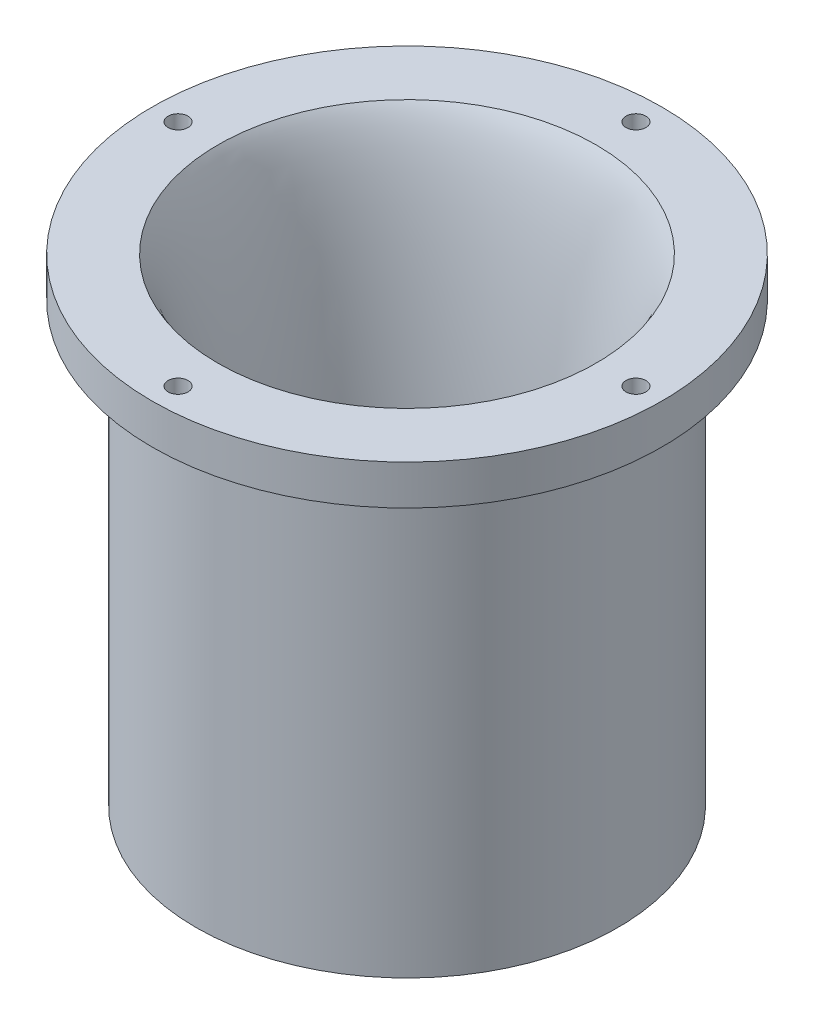
ISO-10303-21;
HEADER;
FILE_DESCRIPTION(('STEP AP214'),'2;1');
FILE_NAME('part.step','',(''),(''),'','','');
FILE_SCHEMA(('AUTOMOTIVE_DESIGN { 1 0 10303 214 1 1 1 1 }'));
ENDSEC;
DATA;
#1=APPLICATION_CONTEXT('core data for automotive mechanical design processes');
#2=APPLICATION_PROTOCOL_DEFINITION('international standard','automotive_design',2000,#1);
#3=PRODUCT_CONTEXT('',#1,'mechanical');
#4=PRODUCT('Part','Part','',(#3));
#5=PRODUCT_RELATED_PRODUCT_CATEGORY('part','',(#4));
#6=PRODUCT_DEFINITION_FORMATION('','',#4);
#7=PRODUCT_DEFINITION_CONTEXT('part definition',#1,'design');
#8=PRODUCT_DEFINITION('design','',#6,#7);
#9=PRODUCT_DEFINITION_SHAPE('','',#8);
#10=(LENGTH_UNIT() NAMED_UNIT(*) SI_UNIT(.MILLI.,.METRE.));
#11=(NAMED_UNIT(*) PLANE_ANGLE_UNIT() SI_UNIT($,.RADIAN.));
#12=(NAMED_UNIT(*) SI_UNIT($,.STERADIAN.) SOLID_ANGLE_UNIT());
#13=UNCERTAINTY_MEASURE_WITH_UNIT(LENGTH_MEASURE(1.E-05),#10,'distance_accuracy_value','');
#14=(GEOMETRIC_REPRESENTATION_CONTEXT(3) GLOBAL_UNCERTAINTY_ASSIGNED_CONTEXT((#13)) GLOBAL_UNIT_ASSIGNED_CONTEXT((#10,
#11,#12)) REPRESENTATION_CONTEXT('',''));
#15=CARTESIAN_POINT('',(0.,0.,0.));
#16=DIRECTION('',(0.,0.,1.));
#17=DIRECTION('',(1.,0.,0.));
#18=AXIS2_PLACEMENT_3D('',#15,#16,#17);
#19=CARTESIAN_POINT('',(0.,0.,-35.));
#20=CARTESIAN_POINT('',(0.,0.743462171305286,-35.));
#21=CARTESIAN_POINT('',(0.,3.60426320335067,-35.0360451741196));
#22=CARTESIAN_POINT('',(0.,30.1874880901123,-34.5551949604651));
#23=CARTESIAN_POINT('',(0.,87.1238245562337,-38.452213163152));
#24=CARTESIAN_POINT('',(0.,100.,-47.5));
#25=B_SPLINE_CURVE_WITH_KNOTS('',3,(#19,#20,#21,#22,#23,#24),.UNSPECIFIED.,.F.,.F.,(4,1,1,4),
(0.,0.0402839169169661,0.140283916916966,1.),.UNSPECIFIED.);
#26=CARTESIAN_POINT('',(0.,0.,0.));
#27=DIRECTION('',(0.,-1.,0.));
#28=AXIS1_PLACEMENT('',#26,#27);
#29=SURFACE_OF_REVOLUTION('',#25,#28);
#30=CARTESIAN_POINT('',(0.,100.,0.));
#31=DIRECTION('',(0.,-1.,0.));
#32=DIRECTION('',(0.,0.,-1.));
#33=AXIS2_PLACEMENT_3D('',#30,#31,#32);
#34=CIRCLE('',#33,47.5);
#35=CARTESIAN_POINT('',(0.,100.,-47.5));
#36=VERTEX_POINT('',#35);
#37=EDGE_CURVE('E65',#36,#36,#34,.T.);
#38=ORIENTED_EDGE('',*,*,#37,.F.);
#39=EDGE_LOOP('',(#38));
#40=FACE_BOUND('',#39,.T.);
#41=CARTESIAN_POINT('',(0.,0.,0.));
#42=DIRECTION('',(0.,-1.,0.));
#43=DIRECTION('',(0.,0.,-1.));
#44=AXIS2_PLACEMENT_3D('',#41,#42,#43);
#45=CIRCLE('',#44,35.);
#46=CARTESIAN_POINT('',(0.,0.,-35.));
#47=VERTEX_POINT('',#46);
#48=EDGE_CURVE('E10',#47,#47,#45,.T.);
#49=ORIENTED_EDGE('',*,*,#48,.T.);
#50=EDGE_LOOP('',(#49));
#51=FACE_BOUND('',#50,.T.);
#52=ADVANCED_FACE('F36',(#40,#51),#29,.T.);
#53=CARTESIAN_POINT('',(0.,0.,0.));
#54=DIRECTION('',(0.,-1.,0.));
#55=DIRECTION('',(0.,0.,-1.));
#56=AXIS2_PLACEMENT_3D('',#53,#54,#55);
#57=PLANE('',#56);
#58=CARTESIAN_POINT('',(0.,0.,0.));
#59=DIRECTION('',(0.,-1.,0.));
#60=DIRECTION('',(0.,0.,-1.));
#61=AXIS2_PLACEMENT_3D('',#58,#59,#60);
#62=CIRCLE('',#61,38.);
#63=CARTESIAN_POINT('',(0.,0.,-38.));
#64=VERTEX_POINT('',#63);
#65=EDGE_CURVE('E43',#64,#64,#62,.T.);
#66=ORIENTED_EDGE('',*,*,#65,.T.);
#67=EDGE_LOOP('',(#66));
#68=FACE_BOUND('',#67,.T.);
#69=ORIENTED_EDGE('',*,*,#48,.F.);
#70=EDGE_LOOP('',(#69));
#71=FACE_BOUND('',#70,.T.);
#72=ADVANCED_FACE('F135',(#68,#71),#57,.T.);
#73=CARTESIAN_POINT('',(0.,0.,0.));
#74=DIRECTION('',(0.,-1.,0.));
#75=DIRECTION('',(0.,0.,-1.));
#76=AXIS2_PLACEMENT_3D('',#73,#74,#75);
#77=CYLINDRICAL_SURFACE('',#76,38.);
#78=CARTESIAN_POINT('',(0.,-20.,0.));
#79=DIRECTION('',(0.,-1.,0.));
#80=DIRECTION('',(0.,0.,-1.));
#81=AXIS2_PLACEMENT_3D('',#78,#79,#80);
#82=CIRCLE('',#81,38.);
#83=CARTESIAN_POINT('',(0.,-20.,-38.));
#84=VERTEX_POINT('',#83);
#85=EDGE_CURVE('E47',#84,#84,#82,.T.);
#86=ORIENTED_EDGE('',*,*,#85,.T.);
#87=EDGE_LOOP('',(#86));
#88=FACE_BOUND('',#87,.T.);
#89=ORIENTED_EDGE('',*,*,#65,.F.);
#90=EDGE_LOOP('',(#89));
#91=FACE_BOUND('',#90,.T.);
#92=ADVANCED_FACE('F140',(#88,#91),#77,.F.);
#93=CARTESIAN_POINT('',(0.,-20.,0.));
#94=DIRECTION('',(0.,-1.,0.));
#95=DIRECTION('',(0.,0.,-1.));
#96=AXIS2_PLACEMENT_3D('',#93,#94,#95);
#97=PLANE('',#96);
#98=CARTESIAN_POINT('',(0.,-20.,0.));
#99=DIRECTION('',(0.,-1.,0.));
#100=DIRECTION('',(0.,0.,-1.));
#101=AXIS2_PLACEMENT_3D('',#98,#99,#100);
#102=CIRCLE('',#101,53.);
#103=CARTESIAN_POINT('',(0.,-20.,-53.));
#104=VERTEX_POINT('',#103);
#105=EDGE_CURVE('E51',#104,#104,#102,.T.);
#106=ORIENTED_EDGE('',*,*,#105,.T.);
#107=EDGE_LOOP('',(#106));
#108=FACE_BOUND('',#107,.T.);
#109=ORIENTED_EDGE('',*,*,#85,.F.);
#110=EDGE_LOOP('',(#109));
#111=FACE_BOUND('',#110,.T.);
#112=ADVANCED_FACE('F144',(#108,#111),#97,.T.);
#113=CARTESIAN_POINT('',(0.,0.,0.));
#114=DIRECTION('',(0.,-1.,0.));
#115=DIRECTION('',(0.,0.,-1.));
#116=AXIS2_PLACEMENT_3D('',#113,#114,#115);
#117=CYLINDRICAL_SURFACE('',#116,53.);
#118=CARTESIAN_POINT('',(0.,90.,0.));
#119=DIRECTION('',(0.,-1.,0.));
#120=DIRECTION('',(0.,0.,-1.));
#121=AXIS2_PLACEMENT_3D('',#118,#119,#120);
#122=CIRCLE('',#121,53.);
#123=CARTESIAN_POINT('',(0.,90.,-53.));
#124=VERTEX_POINT('',#123);
#125=EDGE_CURVE('E56',#124,#124,#122,.T.);
#126=ORIENTED_EDGE('',*,*,#125,.T.);
#127=EDGE_LOOP('',(#126));
#128=FACE_BOUND('',#127,.T.);
#129=ORIENTED_EDGE('',*,*,#105,.F.);
#130=EDGE_LOOP('',(#129));
#131=FACE_BOUND('',#130,.T.);
#132=ADVANCED_FACE('F131',(#128,#131),#117,.T.);
#133=CARTESIAN_POINT('',(0.,90.,0.));
#134=DIRECTION('',(0.,-1.,0.));
#135=DIRECTION('',(0.,0.,-1.));
#136=AXIS2_PLACEMENT_3D('',#133,#134,#135);
#137=PLANE('',#136);
#138=CARTESIAN_POINT('',(1.62720657315313E-12,90.,-57.5));
#139=DIRECTION('',(0.,1.,0.));
#140=DIRECTION('',(0.,0.,1.));
#141=AXIS2_PLACEMENT_3D('',#138,#139,#140);
#142=CIRCLE('',#141,2.49999999999844);
#143=CARTESIAN_POINT('',(1.62720657315313E-12,90.,-55.0000000000016));
#144=VERTEX_POINT('',#143);
#145=EDGE_CURVE('E67',#144,#144,#142,.T.);
#146=ORIENTED_EDGE('',*,*,#145,.T.);
#147=EDGE_LOOP('',(#146));
#148=FACE_BOUND('',#147,.T.);
#149=CARTESIAN_POINT('',(57.5000000000016,90.,0.));
#150=DIRECTION('',(0.,1.,0.));
#151=DIRECTION('',(0.,0.,1.));
#152=AXIS2_PLACEMENT_3D('',#149,#150,#151);
#153=CIRCLE('',#152,2.50000000000048);
#154=CARTESIAN_POINT('',(57.5000000000016,90.,2.50000000000048));
#155=VERTEX_POINT('',#154);
#156=EDGE_CURVE('E90',#155,#155,#153,.T.);
#157=ORIENTED_EDGE('',*,*,#156,.T.);
#158=EDGE_LOOP('',(#157));
#159=FACE_BOUND('',#158,.T.);
#160=CARTESIAN_POINT('',(1.62720657315313E-12,90.,57.5));
#161=DIRECTION('',(0.,1.,0.));
#162=DIRECTION('',(0.,0.,1.));
#163=AXIS2_PLACEMENT_3D('',#160,#161,#162);
#164=CIRCLE('',#163,2.50000000000156);
#165=CARTESIAN_POINT('',(1.62720657315313E-12,90.,60.0000000000016));
#166=VERTEX_POINT('',#165);
#167=EDGE_CURVE('E84',#166,#166,#164,.T.);
#168=ORIENTED_EDGE('',*,*,#167,.T.);
#169=EDGE_LOOP('',(#168));
#170=FACE_BOUND('',#169,.T.);
#171=CARTESIAN_POINT('',(-57.4999999999984,90.,0.));
#172=DIRECTION('',(0.,1.,0.));
#173=DIRECTION('',(0.,0.,1.));
#174=AXIS2_PLACEMENT_3D('',#171,#172,#173);
#175=CIRCLE('',#174,2.49999999999953);
#176=CARTESIAN_POINT('',(-57.4999999999984,90.,2.49999999999953));
#177=VERTEX_POINT('',#176);
#178=EDGE_CURVE('E78',#177,#177,#175,.T.);
#179=ORIENTED_EDGE('',*,*,#178,.T.);
#180=EDGE_LOOP('',(#179));
#181=FACE_BOUND('',#180,.T.);
#182=CARTESIAN_POINT('',(0.,90.,0.));
#183=DIRECTION('',(0.,-1.,0.));
#184=DIRECTION('',(0.,0.,-1.));
#185=AXIS2_PLACEMENT_3D('',#182,#183,#184);
#186=CIRCLE('',#185,64.);
#187=CARTESIAN_POINT('',(0.,90.,-64.));
#188=VERTEX_POINT('',#187);
#189=EDGE_CURVE('E59',#188,#188,#186,.T.);
#190=ORIENTED_EDGE('',*,*,#189,.T.);
#191=EDGE_LOOP('',(#190));
#192=FACE_BOUND('',#191,.T.);
#193=ORIENTED_EDGE('',*,*,#125,.F.);
#194=EDGE_LOOP('',(#193));
#195=FACE_BOUND('',#194,.T.);
#196=ADVANCED_FACE('F99',(#148,#159,#170,#181,#192,#195),#137,.T.);
#197=CARTESIAN_POINT('',(0.,0.,0.));
#198=DIRECTION('',(0.,-1.,0.));
#199=DIRECTION('',(0.,0.,-1.));
#200=AXIS2_PLACEMENT_3D('',#197,#198,#199);
#201=CYLINDRICAL_SURFACE('',#200,64.);
#202=ORIENTED_EDGE('',*,*,#189,.F.);
#203=EDGE_LOOP('',(#202));
#204=FACE_BOUND('',#203,.T.);
#205=CARTESIAN_POINT('',(0.,100.,0.));
#206=DIRECTION('',(0.,-1.,0.));
#207=DIRECTION('',(0.,0.,-1.));
#208=AXIS2_PLACEMENT_3D('',#205,#206,#207);
#209=CIRCLE('',#208,64.);
#210=CARTESIAN_POINT('',(0.,100.,-64.));
#211=VERTEX_POINT('',#210);
#212=EDGE_CURVE('E62',#211,#211,#209,.T.);
#213=ORIENTED_EDGE('',*,*,#212,.T.);
#214=EDGE_LOOP('',(#213));
#215=FACE_BOUND('',#214,.T.);
#216=ADVANCED_FACE('F113',(#204,#215),#201,.T.);
#217=CARTESIAN_POINT('',(0.,100.,0.));
#218=DIRECTION('',(0.,1.,0.));
#219=DIRECTION('',(0.,0.,1.));
#220=AXIS2_PLACEMENT_3D('',#217,#218,#219);
#221=PLANE('',#220);
#222=CARTESIAN_POINT('',(1.62720657315313E-12,100.,-57.5));
#223=DIRECTION('',(0.,1.,0.));
#224=DIRECTION('',(0.,0.,1.));
#225=AXIS2_PLACEMENT_3D('',#222,#223,#224);
#226=CIRCLE('',#225,2.49999999999844);
#227=CARTESIAN_POINT('',(1.62720657315313E-12,100.,-55.0000000000016));
#228=VERTEX_POINT('',#227);
#229=EDGE_CURVE('E93',#228,#228,#226,.T.);
#230=ORIENTED_EDGE('',*,*,#229,.F.);
#231=EDGE_LOOP('',(#230));
#232=FACE_BOUND('',#231,.T.);
#233=CARTESIAN_POINT('',(57.5000000000016,100.,0.));
#234=DIRECTION('',(0.,1.,0.));
#235=DIRECTION('',(0.,0.,1.));
#236=AXIS2_PLACEMENT_3D('',#233,#234,#235);
#237=CIRCLE('',#236,2.50000000000048);
#238=CARTESIAN_POINT('',(57.5000000000016,100.,2.50000000000048));
#239=VERTEX_POINT('',#238);
#240=EDGE_CURVE('E87',#239,#239,#237,.T.);
#241=ORIENTED_EDGE('',*,*,#240,.F.);
#242=EDGE_LOOP('',(#241));
#243=FACE_BOUND('',#242,.T.);
#244=CARTESIAN_POINT('',(1.62720657315313E-12,100.,57.5));
#245=DIRECTION('',(0.,1.,0.));
#246=DIRECTION('',(0.,0.,1.));
#247=AXIS2_PLACEMENT_3D('',#244,#245,#246);
#248=CIRCLE('',#247,2.50000000000156);
#249=CARTESIAN_POINT('',(1.62720657315313E-12,100.,60.0000000000016));
#250=VERTEX_POINT('',#249);
#251=EDGE_CURVE('E81',#250,#250,#248,.T.);
#252=ORIENTED_EDGE('',*,*,#251,.F.);
#253=EDGE_LOOP('',(#252));
#254=FACE_BOUND('',#253,.T.);
#255=CARTESIAN_POINT('',(-57.4999999999984,100.,0.));
#256=DIRECTION('',(0.,1.,0.));
#257=DIRECTION('',(0.,0.,1.));
#258=AXIS2_PLACEMENT_3D('',#255,#256,#257);
#259=CIRCLE('',#258,2.49999999999953);
#260=CARTESIAN_POINT('',(-57.4999999999984,100.,2.49999999999953));
#261=VERTEX_POINT('',#260);
#262=EDGE_CURVE('E72',#261,#261,#259,.T.);
#263=ORIENTED_EDGE('',*,*,#262,.F.);
#264=EDGE_LOOP('',(#263));
#265=FACE_BOUND('',#264,.T.);
#266=ORIENTED_EDGE('',*,*,#37,.T.);
#267=EDGE_LOOP('',(#266));
#268=FACE_BOUND('',#267,.T.);
#269=ORIENTED_EDGE('',*,*,#212,.F.);
#270=EDGE_LOOP('',(#269));
#271=FACE_BOUND('',#270,.T.);
#272=ADVANCED_FACE('F109',(#232,#243,#254,#265,#268,#271),#221,.T.);
#273=CARTESIAN_POINT('',(-57.4999999999984,90.,0.));
#274=DIRECTION('',(0.,1.,0.));
#275=DIRECTION('',(0.,0.,1.));
#276=AXIS2_PLACEMENT_3D('',#273,#274,#275);
#277=CYLINDRICAL_SURFACE('',#276,2.49999999999953);
#278=ORIENTED_EDGE('',*,*,#178,.F.);
#279=EDGE_LOOP('',(#278));
#280=FACE_BOUND('',#279,.T.);
#281=ORIENTED_EDGE('',*,*,#262,.T.);
#282=EDGE_LOOP('',(#281));
#283=FACE_BOUND('',#282,.T.);
#284=ADVANCED_FACE('F112',(#280,#283),#277,.F.);
#285=CARTESIAN_POINT('',(1.62720657315313E-12,90.,57.5));
#286=DIRECTION('',(0.,1.,0.));
#287=DIRECTION('',(0.,0.,1.));
#288=AXIS2_PLACEMENT_3D('',#285,#286,#287);
#289=CYLINDRICAL_SURFACE('',#288,2.50000000000156);
#290=ORIENTED_EDGE('',*,*,#167,.F.);
#291=EDGE_LOOP('',(#290));
#292=FACE_BOUND('',#291,.T.);
#293=ORIENTED_EDGE('',*,*,#251,.T.);
#294=EDGE_LOOP('',(#293));
#295=FACE_BOUND('',#294,.T.);
#296=ADVANCED_FACE('F187',(#292,#295),#289,.F.);
#297=CARTESIAN_POINT('',(57.5000000000016,90.,0.));
#298=DIRECTION('',(0.,1.,0.));
#299=DIRECTION('',(0.,0.,1.));
#300=AXIS2_PLACEMENT_3D('',#297,#298,#299);
#301=CYLINDRICAL_SURFACE('',#300,2.50000000000048);
#302=ORIENTED_EDGE('',*,*,#156,.F.);
#303=EDGE_LOOP('',(#302));
#304=FACE_BOUND('',#303,.T.);
#305=ORIENTED_EDGE('',*,*,#240,.T.);
#306=EDGE_LOOP('',(#305));
#307=FACE_BOUND('',#306,.T.);
#308=ADVANCED_FACE('F105',(#304,#307),#301,.F.);
#309=CARTESIAN_POINT('',(1.62720657315313E-12,90.,-57.5));
#310=DIRECTION('',(0.,1.,0.));
#311=DIRECTION('',(0.,0.,1.));
#312=AXIS2_PLACEMENT_3D('',#309,#310,#311);
#313=CYLINDRICAL_SURFACE('',#312,2.49999999999844);
#314=ORIENTED_EDGE('',*,*,#145,.F.);
#315=EDGE_LOOP('',(#314));
#316=FACE_BOUND('',#315,.T.);
#317=ORIENTED_EDGE('',*,*,#229,.T.);
#318=EDGE_LOOP('',(#317));
#319=FACE_BOUND('',#318,.T.);
#320=ADVANCED_FACE('F102',(#316,#319),#313,.F.);
#321=CLOSED_SHELL('',(#52,#72,#92,#112,#132,#196,#216,#272,#284,#296,#308,#320));
#322=MANIFOLD_SOLID_BREP('B2',#321);
#323=ADVANCED_BREP_SHAPE_REPRESENTATION('',(#18,#322),#14);
#324=SHAPE_DEFINITION_REPRESENTATION(#9,#323);
ENDSEC;
END-ISO-10303-21;
